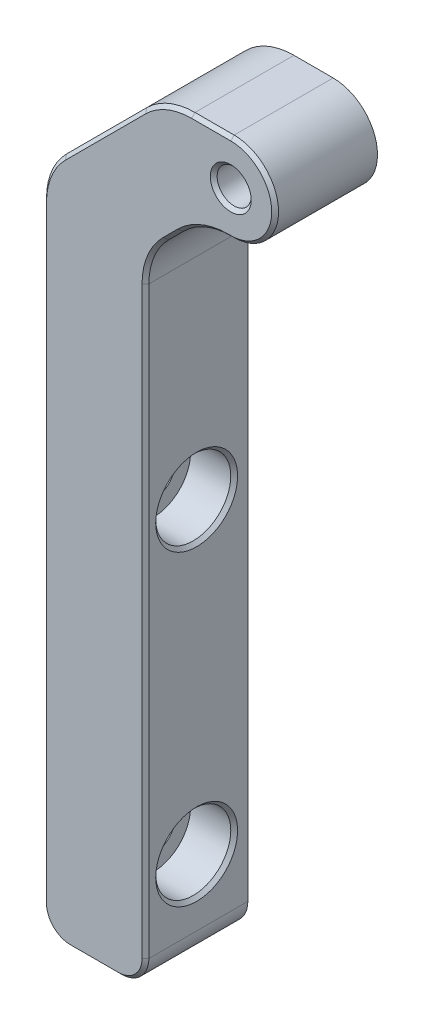
ISO-10303-21;
HEADER;
FILE_DESCRIPTION(('STEP AP214'),'2;1');
FILE_NAME('part.step','',(''),(''),'','','');
FILE_SCHEMA(('AUTOMOTIVE_DESIGN { 1 0 10303 214 1 1 1 1 }'));
ENDSEC;
DATA;
#1=APPLICATION_CONTEXT('core data for automotive mechanical design processes');
#2=APPLICATION_PROTOCOL_DEFINITION('international standard','automotive_design',2000,#1);
#3=PRODUCT_CONTEXT('',#1,'mechanical');
#4=PRODUCT('Part','Part','',(#3));
#5=PRODUCT_RELATED_PRODUCT_CATEGORY('part','',(#4));
#6=PRODUCT_DEFINITION_FORMATION('','',#4);
#7=PRODUCT_DEFINITION_CONTEXT('part definition',#1,'design');
#8=PRODUCT_DEFINITION('design','',#6,#7);
#9=PRODUCT_DEFINITION_SHAPE('','',#8);
#10=(LENGTH_UNIT() NAMED_UNIT(*) SI_UNIT(.MILLI.,.METRE.));
#11=(NAMED_UNIT(*) PLANE_ANGLE_UNIT() SI_UNIT($,.RADIAN.));
#12=(NAMED_UNIT(*) SI_UNIT($,.STERADIAN.) SOLID_ANGLE_UNIT());
#13=UNCERTAINTY_MEASURE_WITH_UNIT(LENGTH_MEASURE(1.E-05),#10,'distance_accuracy_value','');
#14=(GEOMETRIC_REPRESENTATION_CONTEXT(3) GLOBAL_UNCERTAINTY_ASSIGNED_CONTEXT((#13)) GLOBAL_UNIT_ASSIGNED_CONTEXT((#10,
#11,#12)) REPRESENTATION_CONTEXT('',''));
#15=CARTESIAN_POINT('',(0.,0.,0.));
#16=DIRECTION('',(0.,0.,1.));
#17=DIRECTION('',(1.,0.,0.));
#18=AXIS2_PLACEMENT_3D('',#15,#16,#17);
#19=CARTESIAN_POINT('',(26.4140960718114,32.7908047863379,15.));
#20=DIRECTION('',(0.,0.,-1.));
#21=DIRECTION('',(-1.,0.,0.));
#22=AXIS2_PLACEMENT_3D('',#19,#20,#21);
#23=CYLINDRICAL_SURFACE('',#22,6.49999999999695);
#24=DIRECTION('',(0.,0.,-1.));
#25=VECTOR('',#24,1.);
#26=CARTESIAN_POINT('',(26.4140960718114,39.2908047863348,15.));
#27=LINE('',#26,#25);
#28=CARTESIAN_POINT('',(26.4140960718114,39.2908047863348,14.5));
#29=VERTEX_POINT('',#28);
#30=CARTESIAN_POINT('',(26.4140960718114,39.2908047863348,0.));
#31=VERTEX_POINT('',#30);
#32=EDGE_CURVE('E178',#29,#31,#27,.T.);
#33=ORIENTED_EDGE('',*,*,#32,.F.);
#34=CARTESIAN_POINT('',(26.4140960718114,32.7908047863379,14.5));
#35=DIRECTION('',(0.,0.,1.));
#36=DIRECTION('',(1.,0.,0.));
#37=AXIS2_PLACEMENT_3D('',#34,#35,#36);
#38=CIRCLE('',#37,6.49999999999695);
#39=CARTESIAN_POINT('',(26.4140960718114,26.2908047863409,14.5));
#40=VERTEX_POINT('',#39);
#41=EDGE_CURVE('E324',#29,#40,#38,.F.);
#42=ORIENTED_EDGE('',*,*,#41,.T.);
#43=DIRECTION('',(0.,0.,-1.));
#44=VECTOR('',#43,1.);
#45=CARTESIAN_POINT('',(26.4140960718114,26.2908047863409,15.));
#46=LINE('',#45,#44);
#47=CARTESIAN_POINT('',(26.4140960718114,26.2908047863409,0.));
#48=VERTEX_POINT('',#47);
#49=EDGE_CURVE('E202',#40,#48,#46,.T.);
#50=ORIENTED_EDGE('',*,*,#49,.T.);
#51=CARTESIAN_POINT('',(26.4140960718114,32.7908047863379,0.));
#52=DIRECTION('',(0.,0.,1.));
#53=DIRECTION('',(1.,0.,0.));
#54=AXIS2_PLACEMENT_3D('',#51,#52,#53);
#55=CIRCLE('',#54,6.49999999999695);
#56=EDGE_CURVE('E196',#48,#31,#55,.T.);
#57=ORIENTED_EDGE('',*,*,#56,.T.);
#58=EDGE_LOOP('',(#33,#42,#50,#57));
#59=FACE_BOUND('',#58,.T.);
#60=ADVANCED_FACE('F33',(#59),#23,.T.);
#61=CARTESIAN_POINT('',(26.4140960718114,39.2908047863348,15.));
#62=DIRECTION('',(0.,-1.,0.));
#63=DIRECTION('',(0.,0.,-1.));
#64=AXIS2_PLACEMENT_3D('',#61,#62,#63);
#65=PLANE('',#64);
#66=DIRECTION('',(0.,0.,-1.));
#67=VECTOR('',#66,1.);
#68=CARTESIAN_POINT('',(20.6714553846794,39.2908047863348,15.));
#69=LINE('',#68,#67);
#70=CARTESIAN_POINT('',(20.6714553846794,39.2908047863348,14.5));
#71=VERTEX_POINT('',#70);
#72=CARTESIAN_POINT('',(20.6714553846794,39.2908047863348,0.));
#73=VERTEX_POINT('',#72);
#74=EDGE_CURVE('E190',#71,#73,#69,.T.);
#75=ORIENTED_EDGE('',*,*,#74,.F.);
#76=DIRECTION('',(1.,0.,0.));
#77=VECTOR('',#76,1.);
#78=CARTESIAN_POINT('',(26.4140960718114,39.2908047863348,14.5));
#79=LINE('',#78,#77);
#80=EDGE_CURVE('E185',#71,#29,#79,.T.);
#81=ORIENTED_EDGE('',*,*,#80,.T.);
#82=ORIENTED_EDGE('',*,*,#32,.T.);
#83=DIRECTION('',(-1.,0.,0.));
#84=VECTOR('',#83,1.);
#85=CARTESIAN_POINT('',(26.4140960718114,39.2908047863348,0.));
#86=LINE('',#85,#84);
#87=EDGE_CURVE('E182',#31,#73,#86,.T.);
#88=ORIENTED_EDGE('',*,*,#87,.T.);
#89=EDGE_LOOP('',(#75,#81,#82,#88));
#90=FACE_BOUND('',#89,.T.);
#91=ADVANCED_FACE('F181',(#90),#65,.F.);
#92=CARTESIAN_POINT('',(20.6714553846793,29.2908047863348,15.));
#93=DIRECTION('',(0.,0.,-1.));
#94=DIRECTION('',(-1.,0.,0.));
#95=AXIS2_PLACEMENT_3D('',#92,#93,#94);
#96=CYLINDRICAL_SURFACE('',#95,10.);
#97=DIRECTION('',(0.,0.,-1.));
#98=VECTOR('',#97,1.);
#99=CARTESIAN_POINT('',(13.6003875728138,36.3618725982003,15.));
#100=LINE('',#99,#98);
#101=CARTESIAN_POINT('',(13.6003875728138,36.3618725982003,14.5));
#102=VERTEX_POINT('',#101);
#103=CARTESIAN_POINT('',(13.6003875728138,36.3618725982003,0.));
#104=VERTEX_POINT('',#103);
#105=EDGE_CURVE('E265',#102,#104,#100,.T.);
#106=ORIENTED_EDGE('',*,*,#105,.F.);
#107=CARTESIAN_POINT('',(20.6714553846793,29.2908047863348,14.5));
#108=DIRECTION('',(0.,0.,1.));
#109=DIRECTION('',(1.,0.,0.));
#110=AXIS2_PLACEMENT_3D('',#107,#108,#109);
#111=CIRCLE('',#110,10.);
#112=EDGE_CURVE('E316',#102,#71,#111,.F.);
#113=ORIENTED_EDGE('',*,*,#112,.T.);
#114=ORIENTED_EDGE('',*,*,#74,.T.);
#115=CARTESIAN_POINT('',(20.6714553846793,29.2908047863348,0.));
#116=DIRECTION('',(0.,0.,1.));
#117=DIRECTION('',(1.,0.,0.));
#118=AXIS2_PLACEMENT_3D('',#115,#116,#117);
#119=CIRCLE('',#118,10.);
#120=EDGE_CURVE('E199',#73,#104,#119,.T.);
#121=ORIENTED_EDGE('',*,*,#120,.T.);
#122=EDGE_LOOP('',(#106,#113,#114,#121));
#123=FACE_BOUND('',#122,.T.);
#124=ADVANCED_FACE('F433',(#123),#96,.T.);
#125=CARTESIAN_POINT('',(13.6003875728138,36.3618725982003,15.));
#126=DIRECTION('',(0.707106781186547,-0.707106781186547,0.));
#127=DIRECTION('',(0.707106781186548,0.707106781186548,0.));
#128=AXIS2_PLACEMENT_3D('',#125,#126,#127);
#129=PLANE('',#128);
#130=DIRECTION('',(0.,0.,-1.));
#131=VECTOR('',#130,1.);
#132=CARTESIAN_POINT('',(1.84302825994298,24.6045132853294,15.));
#133=LINE('',#132,#131);
#134=CARTESIAN_POINT('',(1.84302825994298,24.6045132853294,14.5));
#135=VERTEX_POINT('',#134);
#136=CARTESIAN_POINT('',(1.84302825994298,24.6045132853294,0.));
#137=VERTEX_POINT('',#136);
#138=EDGE_CURVE('E263',#135,#137,#133,.T.);
#139=ORIENTED_EDGE('',*,*,#138,.F.);
#140=DIRECTION('',(0.707106781186548,0.707106781186548,0.));
#141=VECTOR('',#140,1.);
#142=CARTESIAN_POINT('',(13.6003875728138,36.3618725982003,14.5));
#143=LINE('',#142,#141);
#144=EDGE_CURVE('E319',#135,#102,#143,.T.);
#145=ORIENTED_EDGE('',*,*,#144,.T.);
#146=ORIENTED_EDGE('',*,*,#105,.T.);
#147=DIRECTION('',(-0.707106781186547,-0.707106781186547,0.));
#148=VECTOR('',#147,1.);
#149=CARTESIAN_POINT('',(13.6003875728138,36.3618725982003,0.));
#150=LINE('',#149,#148);
#151=EDGE_CURVE('E212',#104,#137,#150,.T.);
#152=ORIENTED_EDGE('',*,*,#151,.T.);
#153=EDGE_LOOP('',(#139,#145,#146,#152));
#154=FACE_BOUND('',#153,.T.);
#155=ADVANCED_FACE('F549',(#154),#129,.F.);
#156=CARTESIAN_POINT('',(8.91409607180843,17.5334454734639,15.));
#157=DIRECTION('',(0.,0.,-1.));
#158=DIRECTION('',(-1.,0.,0.));
#159=AXIS2_PLACEMENT_3D('',#156,#157,#158);
#160=CYLINDRICAL_SURFACE('',#159,10.);
#161=DIRECTION('',(0.,0.,-1.));
#162=VECTOR('',#161,1.);
#163=CARTESIAN_POINT('',(-1.08590392819157,17.5334454734639,15.));
#164=LINE('',#163,#162);
#165=CARTESIAN_POINT('',(-1.08590392819157,17.5334454734639,14.5));
#166=VERTEX_POINT('',#165);
#167=CARTESIAN_POINT('',(-1.08590392819157,17.5334454734639,0.));
#168=VERTEX_POINT('',#167);
#169=EDGE_CURVE('E261',#166,#168,#164,.T.);
#170=ORIENTED_EDGE('',*,*,#169,.F.);
#171=CARTESIAN_POINT('',(8.91409607180843,17.5334454734639,14.5));
#172=DIRECTION('',(0.,0.,1.));
#173=DIRECTION('',(1.,0.,0.));
#174=AXIS2_PLACEMENT_3D('',#171,#172,#173);
#175=CIRCLE('',#174,10.);
#176=EDGE_CURVE('E322',#166,#135,#175,.F.);
#177=ORIENTED_EDGE('',*,*,#176,.T.);
#178=ORIENTED_EDGE('',*,*,#138,.T.);
#179=CARTESIAN_POINT('',(8.91409607180843,17.5334454734639,0.));
#180=DIRECTION('',(0.,0.,1.));
#181=DIRECTION('',(1.,0.,0.));
#182=AXIS2_PLACEMENT_3D('',#179,#180,#181);
#183=CIRCLE('',#182,10.);
#184=EDGE_CURVE('E215',#137,#168,#183,.T.);
#185=ORIENTED_EDGE('',*,*,#184,.T.);
#186=EDGE_LOOP('',(#170,#177,#178,#185));
#187=FACE_BOUND('',#186,.T.);
#188=ADVANCED_FACE('F545',(#187),#160,.T.);
#189=CARTESIAN_POINT('',(-1.08590392819158,-71.4592049495357,15.));
#190=DIRECTION('',(1.,0.,0.));
#191=DIRECTION('',(0.,0.,-1.));
#192=AXIS2_PLACEMENT_3D('',#189,#190,#191);
#193=PLANE('',#192);
#194=CARTESIAN_POINT('',(-1.08590392819158,-16.7091952136652,7.49999999999999));
#195=DIRECTION('',(1.,0.,0.));
#196=DIRECTION('',(0.,0.,-1.));
#197=AXIS2_PLACEMENT_3D('',#194,#195,#196);
#198=CIRCLE('',#197,3.3);
#199=CARTESIAN_POINT('',(-1.08590392819158,-16.7091952136652,4.19999999999999));
#200=VERTEX_POINT('',#199);
#201=EDGE_CURVE('E388',#200,#200,#198,.T.);
#202=ORIENTED_EDGE('',*,*,#201,.T.);
#203=EDGE_LOOP('',(#202));
#204=FACE_BOUND('',#203,.T.);
#205=CARTESIAN_POINT('',(-1.08590392819158,-61.7091952136652,7.49999999999999));
#206=DIRECTION('',(1.,0.,0.));
#207=DIRECTION('',(0.,0.,-1.));
#208=AXIS2_PLACEMENT_3D('',#205,#206,#207);
#209=CIRCLE('',#208,3.3);
#210=CARTESIAN_POINT('',(-1.08590392819158,-61.7091952136652,4.19999999999999));
#211=VERTEX_POINT('',#210);
#212=EDGE_CURVE('E207',#211,#211,#209,.T.);
#213=ORIENTED_EDGE('',*,*,#212,.T.);
#214=EDGE_LOOP('',(#213));
#215=FACE_BOUND('',#214,.T.);
#216=DIRECTION('',(0.,0.,-1.));
#217=VECTOR('',#216,1.);
#218=CARTESIAN_POINT('',(-1.08590392819158,-71.4592049495357,15.));
#219=LINE('',#218,#217);
#220=CARTESIAN_POINT('',(-1.08590392819158,-71.4592049495357,14.5));
#221=VERTEX_POINT('',#220);
#222=CARTESIAN_POINT('',(-1.08590392819158,-71.4592049495357,0.));
#223=VERTEX_POINT('',#222);
#224=EDGE_CURVE('E259',#221,#223,#219,.T.);
#225=ORIENTED_EDGE('',*,*,#224,.F.);
#226=DIRECTION('',(0.,1.,0.));
#227=VECTOR('',#226,1.);
#228=CARTESIAN_POINT('',(-1.08590392819158,17.5334454734639,14.5));
#229=LINE('',#228,#227);
#230=EDGE_CURVE('E326',#221,#166,#229,.T.);
#231=ORIENTED_EDGE('',*,*,#230,.T.);
#232=ORIENTED_EDGE('',*,*,#169,.T.);
#233=DIRECTION('',(0.,-1.,0.));
#234=VECTOR('',#233,1.);
#235=CARTESIAN_POINT('',(-1.08590392819158,-71.4592049495357,0.));
#236=LINE('',#235,#234);
#237=EDGE_CURVE('E218',#168,#223,#236,.T.);
#238=ORIENTED_EDGE('',*,*,#237,.T.);
#239=EDGE_LOOP('',(#225,#231,#232,#238));
#240=FACE_BOUND('',#239,.T.);
#241=ADVANCED_FACE('F401',(#204,#215,#240),#193,.F.);
#242=CARTESIAN_POINT('',(2.91409607180843,-71.4592049495357,15.));
#243=DIRECTION('',(0.,0.,-1.));
#244=DIRECTION('',(-1.,0.,0.));
#245=AXIS2_PLACEMENT_3D('',#242,#243,#244);
#246=CYLINDRICAL_SURFACE('',#245,4.);
#247=DIRECTION('',(0.,0.,-1.));
#248=VECTOR('',#247,1.);
#249=CARTESIAN_POINT('',(2.91409607180843,-75.4592049495357,15.));
#250=LINE('',#249,#248);
#251=CARTESIAN_POINT('',(2.91409607180843,-75.4592049495357,14.5));
#252=VERTEX_POINT('',#251);
#253=CARTESIAN_POINT('',(2.91409607180843,-75.4592049495357,0.));
#254=VERTEX_POINT('',#253);
#255=EDGE_CURVE('E257',#252,#254,#250,.T.);
#256=ORIENTED_EDGE('',*,*,#255,.F.);
#257=CARTESIAN_POINT('',(2.91409607180843,-71.4592049495357,14.5));
#258=DIRECTION('',(0.,0.,1.));
#259=DIRECTION('',(1.,0.,0.));
#260=AXIS2_PLACEMENT_3D('',#257,#258,#259);
#261=CIRCLE('',#260,4.);
#262=EDGE_CURVE('E330',#252,#221,#261,.F.);
#263=ORIENTED_EDGE('',*,*,#262,.T.);
#264=ORIENTED_EDGE('',*,*,#224,.T.);
#265=CARTESIAN_POINT('',(2.91409607180843,-71.4592049495357,0.));
#266=DIRECTION('',(0.,0.,1.));
#267=DIRECTION('',(-1.,0.,0.));
#268=AXIS2_PLACEMENT_3D('',#265,#266,#267);
#269=CIRCLE('',#268,4.);
#270=EDGE_CURVE('E221',#223,#254,#269,.T.);
#271=ORIENTED_EDGE('',*,*,#270,.T.);
#272=EDGE_LOOP('',(#256,#263,#264,#271));
#273=FACE_BOUND('',#272,.T.);
#274=ADVANCED_FACE('F515',(#273),#246,.T.);
#275=CARTESIAN_POINT('',(2.91409607180843,-75.4592049495357,15.));
#276=DIRECTION('',(0.,1.,0.));
#277=DIRECTION('',(0.,0.,1.));
#278=AXIS2_PLACEMENT_3D('',#275,#276,#277);
#279=PLANE('',#278);
#280=DIRECTION('',(0.,0.,-1.));
#281=VECTOR('',#280,1.);
#282=CARTESIAN_POINT('',(9.91409607180471,-75.4592049495357,15.));
#283=LINE('',#282,#281);
#284=CARTESIAN_POINT('',(9.91409607180471,-75.4592049495357,14.5));
#285=VERTEX_POINT('',#284);
#286=CARTESIAN_POINT('',(9.91409607180471,-75.4592049495357,0.));
#287=VERTEX_POINT('',#286);
#288=EDGE_CURVE('E255',#285,#287,#283,.T.);
#289=ORIENTED_EDGE('',*,*,#288,.F.);
#290=DIRECTION('',(-1.,0.,0.));
#291=VECTOR('',#290,1.);
#292=CARTESIAN_POINT('',(2.91409607180843,-75.4592049495357,14.5));
#293=LINE('',#292,#291);
#294=EDGE_CURVE('E334',#285,#252,#293,.T.);
#295=ORIENTED_EDGE('',*,*,#294,.T.);
#296=ORIENTED_EDGE('',*,*,#255,.T.);
#297=DIRECTION('',(1.,0.,0.));
#298=VECTOR('',#297,1.);
#299=CARTESIAN_POINT('',(2.91409607180843,-75.4592049495357,0.));
#300=LINE('',#299,#298);
#301=EDGE_CURVE('E224',#254,#287,#300,.T.);
#302=ORIENTED_EDGE('',*,*,#301,.T.);
#303=EDGE_LOOP('',(#289,#295,#296,#302));
#304=FACE_BOUND('',#303,.T.);
#305=ADVANCED_FACE('F513',(#304),#279,.F.);
#306=CARTESIAN_POINT('',(9.91409607180471,-71.4592049495357,15.));
#307=DIRECTION('',(0.,0.,-1.));
#308=DIRECTION('',(-1.,0.,0.));
#309=AXIS2_PLACEMENT_3D('',#306,#307,#308);
#310=CYLINDRICAL_SURFACE('',#309,4.);
#311=DIRECTION('',(0.,0.,-1.));
#312=VECTOR('',#311,1.);
#313=CARTESIAN_POINT('',(13.9140960718047,-71.4592049495357,15.));
#314=LINE('',#313,#312);
#315=CARTESIAN_POINT('',(13.9140960718047,-71.4592049495357,14.5));
#316=VERTEX_POINT('',#315);
#317=CARTESIAN_POINT('',(13.9140960718047,-71.4592049495357,0.));
#318=VERTEX_POINT('',#317);
#319=EDGE_CURVE('E253',#316,#318,#314,.T.);
#320=ORIENTED_EDGE('',*,*,#319,.F.);
#321=CARTESIAN_POINT('',(9.91409607180471,-71.4592049495357,14.5));
#322=DIRECTION('',(0.,0.,1.));
#323=DIRECTION('',(1.,0.,0.));
#324=AXIS2_PLACEMENT_3D('',#321,#322,#323);
#325=CIRCLE('',#324,4.);
#326=EDGE_CURVE('E42',#316,#285,#325,.F.);
#327=ORIENTED_EDGE('',*,*,#326,.T.);
#328=ORIENTED_EDGE('',*,*,#288,.T.);
#329=CARTESIAN_POINT('',(9.91409607180471,-71.4592049495357,0.));
#330=DIRECTION('',(0.,0.,1.));
#331=DIRECTION('',(1.,0.,0.));
#332=AXIS2_PLACEMENT_3D('',#329,#330,#331);
#333=CIRCLE('',#332,4.);
#334=EDGE_CURVE('E227',#287,#318,#333,.T.);
#335=ORIENTED_EDGE('',*,*,#334,.T.);
#336=EDGE_LOOP('',(#320,#327,#328,#335));
#337=FACE_BOUND('',#336,.T.);
#338=ADVANCED_FACE('F523',(#337),#310,.T.);
#339=CARTESIAN_POINT('',(13.9140960718047,-71.4592049495357,15.));
#340=DIRECTION('',(-1.,0.,0.));
#341=DIRECTION('',(0.,0.,1.));
#342=AXIS2_PLACEMENT_3D('',#339,#340,#341);
#343=PLANE('',#342);
#344=CARTESIAN_POINT('',(13.9140960718047,-61.7091952136652,7.49999999999999));
#345=DIRECTION('',(-1.,0.,0.));
#346=DIRECTION('',(0.,0.,1.));
#347=AXIS2_PLACEMENT_3D('',#344,#345,#346);
#348=CIRCLE('',#347,5.99999999999998);
#349=CARTESIAN_POINT('',(13.9140960718047,-61.7091952136652,13.5));
#350=VERTEX_POINT('',#349);
#351=EDGE_CURVE('E275',#350,#350,#348,.T.);
#352=ORIENTED_EDGE('',*,*,#351,.T.);
#353=EDGE_LOOP('',(#352));
#354=FACE_BOUND('',#353,.T.);
#355=CARTESIAN_POINT('',(13.9140960718047,-16.7091952136652,7.49999999999999));
#356=DIRECTION('',(-1.,0.,0.));
#357=DIRECTION('',(0.,0.,1.));
#358=AXIS2_PLACEMENT_3D('',#355,#356,#357);
#359=CIRCLE('',#358,5.99999999999998);
#360=CARTESIAN_POINT('',(13.9140960718047,-16.7091952136652,13.5));
#361=VERTEX_POINT('',#360);
#362=EDGE_CURVE('E272',#361,#361,#359,.T.);
#363=ORIENTED_EDGE('',*,*,#362,.T.);
#364=EDGE_LOOP('',(#363));
#365=FACE_BOUND('',#364,.T.);
#366=DIRECTION('',(0.,0.,-1.));
#367=VECTOR('',#366,1.);
#368=CARTESIAN_POINT('',(13.9140960718047,14.1486691626099,15.));
#369=LINE('',#368,#367);
#370=CARTESIAN_POINT('',(13.9140960718047,14.1486691626099,14.5));
#371=VERTEX_POINT('',#370);
#372=CARTESIAN_POINT('',(13.9140960718047,14.1486691626099,0.));
#373=VERTEX_POINT('',#372);
#374=EDGE_CURVE('E251',#371,#373,#369,.T.);
#375=ORIENTED_EDGE('',*,*,#374,.F.);
#376=DIRECTION('',(0.,-1.,0.));
#377=VECTOR('',#376,1.);
#378=CARTESIAN_POINT('',(13.9140960718047,-71.4592049495357,14.5));
#379=LINE('',#378,#377);
#380=EDGE_CURVE('E270',#371,#316,#379,.T.);
#381=ORIENTED_EDGE('',*,*,#380,.T.);
#382=ORIENTED_EDGE('',*,*,#319,.T.);
#383=DIRECTION('',(0.,1.,0.));
#384=VECTOR('',#383,1.);
#385=CARTESIAN_POINT('',(13.9140960718047,-71.4592049495357,0.));
#386=LINE('',#385,#384);
#387=EDGE_CURVE('E230',#318,#373,#386,.T.);
#388=ORIENTED_EDGE('',*,*,#387,.T.);
#389=EDGE_LOOP('',(#375,#381,#382,#388));
#390=FACE_BOUND('',#389,.T.);
#391=ADVANCED_FACE('F526',(#354,#365,#390),#343,.F.);
#392=CARTESIAN_POINT('',(23.9140960718047,14.14866916261,15.));
#393=DIRECTION('',(0.,0.,-1.));
#394=DIRECTION('',(-1.,0.,0.));
#395=AXIS2_PLACEMENT_3D('',#392,#393,#394);
#396=CYLINDRICAL_SURFACE('',#395,10.);
#397=DIRECTION('',(0.,0.,-1.));
#398=VECTOR('',#397,1.);
#399=CARTESIAN_POINT('',(16.8430282599393,21.2197369744755,15.));
#400=LINE('',#399,#398);
#401=CARTESIAN_POINT('',(16.8430282599393,21.2197369744755,14.5));
#402=VERTEX_POINT('',#401);
#403=CARTESIAN_POINT('',(16.8430282599393,21.2197369744755,0.));
#404=VERTEX_POINT('',#403);
#405=EDGE_CURVE('E249',#402,#404,#400,.T.);
#406=ORIENTED_EDGE('',*,*,#405,.F.);
#407=CARTESIAN_POINT('',(23.9140960718047,14.14866916261,14.5));
#408=DIRECTION('',(0.,0.,1.));
#409=DIRECTION('',(1.,0.,0.));
#410=AXIS2_PLACEMENT_3D('',#407,#408,#409);
#411=CIRCLE('',#410,10.);
#412=EDGE_CURVE('E11',#402,#371,#411,.T.);
#413=ORIENTED_EDGE('',*,*,#412,.T.);
#414=ORIENTED_EDGE('',*,*,#374,.T.);
#415=CARTESIAN_POINT('',(23.9140960718047,14.14866916261,0.));
#416=DIRECTION('',(0.,0.,-1.));
#417=DIRECTION('',(1.,0.,0.));
#418=AXIS2_PLACEMENT_3D('',#415,#416,#417);
#419=CIRCLE('',#418,10.);
#420=EDGE_CURVE('E233',#373,#404,#419,.T.);
#421=ORIENTED_EDGE('',*,*,#420,.T.);
#422=EDGE_LOOP('',(#406,#413,#414,#421));
#423=FACE_BOUND('',#422,.T.);
#424=ADVANCED_FACE('F528',(#423),#396,.F.);
#425=CARTESIAN_POINT('',(16.8430282599393,21.2197369744755,15.));
#426=DIRECTION('',(-0.707106781186547,0.707106781186547,0.));
#427=DIRECTION('',(-0.707106781186548,-0.707106781186548,0.));
#428=AXIS2_PLACEMENT_3D('',#425,#426,#427);
#429=PLANE('',#428);
#430=DIRECTION('',(0.,0.,-1.));
#431=VECTOR('',#430,1.);
#432=CARTESIAN_POINT('',(18.9851638836702,23.3618725982064,15.));
#433=LINE('',#432,#431);
#434=CARTESIAN_POINT('',(18.9851638836702,23.3618725982064,14.5));
#435=VERTEX_POINT('',#434);
#436=CARTESIAN_POINT('',(18.9851638836702,23.3618725982064,0.));
#437=VERTEX_POINT('',#436);
#438=EDGE_CURVE('E247',#435,#437,#433,.T.);
#439=ORIENTED_EDGE('',*,*,#438,.F.);
#440=DIRECTION('',(-0.707106781186548,-0.707106781186548,0.));
#441=VECTOR('',#440,1.);
#442=CARTESIAN_POINT('',(16.8430282599393,21.2197369744755,14.5));
#443=LINE('',#442,#441);
#444=EDGE_CURVE('E50',#435,#402,#443,.T.);
#445=ORIENTED_EDGE('',*,*,#444,.T.);
#446=ORIENTED_EDGE('',*,*,#405,.T.);
#447=DIRECTION('',(0.707106781186548,0.707106781186548,0.));
#448=VECTOR('',#447,1.);
#449=CARTESIAN_POINT('',(16.8430282599393,21.2197369744755,0.));
#450=LINE('',#449,#448);
#451=EDGE_CURVE('E236',#404,#437,#450,.T.);
#452=ORIENTED_EDGE('',*,*,#451,.T.);
#453=EDGE_LOOP('',(#439,#445,#446,#452));
#454=FACE_BOUND('',#453,.T.);
#455=ADVANCED_FACE('F572',(#454),#429,.F.);
#456=CARTESIAN_POINT('',(26.0562316955357,16.2908047863409,15.));
#457=DIRECTION('',(0.,0.,-1.));
#458=DIRECTION('',(-1.,0.,0.));
#459=AXIS2_PLACEMENT_3D('',#456,#457,#458);
#460=CYLINDRICAL_SURFACE('',#459,10.);
#461=DIRECTION('',(0.,0.,-1.));
#462=VECTOR('',#461,1.);
#463=CARTESIAN_POINT('',(26.0562316955357,26.2908047863409,15.));
#464=LINE('',#463,#462);
#465=CARTESIAN_POINT('',(26.0562316955357,26.2908047863409,14.5));
#466=VERTEX_POINT('',#465);
#467=CARTESIAN_POINT('',(26.0562316955357,26.2908047863409,0.));
#468=VERTEX_POINT('',#467);
#469=EDGE_CURVE('E245',#466,#468,#464,.T.);
#470=ORIENTED_EDGE('',*,*,#469,.F.);
#471=CARTESIAN_POINT('',(26.0562316955357,16.2908047863409,14.5));
#472=DIRECTION('',(0.,0.,1.));
#473=DIRECTION('',(1.,0.,0.));
#474=AXIS2_PLACEMENT_3D('',#471,#472,#473);
#475=CIRCLE('',#474,10.);
#476=EDGE_CURVE('E332',#466,#435,#475,.T.);
#477=ORIENTED_EDGE('',*,*,#476,.T.);
#478=ORIENTED_EDGE('',*,*,#438,.T.);
#479=CARTESIAN_POINT('',(26.0562316955357,16.2908047863409,0.));
#480=DIRECTION('',(0.,0.,-1.));
#481=DIRECTION('',(-1.,0.,0.));
#482=AXIS2_PLACEMENT_3D('',#479,#480,#481);
#483=CIRCLE('',#482,10.);
#484=EDGE_CURVE('E239',#437,#468,#483,.T.);
#485=ORIENTED_EDGE('',*,*,#484,.T.);
#486=EDGE_LOOP('',(#470,#477,#478,#485));
#487=FACE_BOUND('',#486,.T.);
#488=ADVANCED_FACE('F571',(#487),#460,.F.);
#489=CARTESIAN_POINT('',(26.4140960718114,26.2908047863409,15.));
#490=DIRECTION('',(0.,1.,0.));
#491=DIRECTION('',(0.,0.,1.));
#492=AXIS2_PLACEMENT_3D('',#489,#490,#491);
#493=PLANE('',#492);
#494=ORIENTED_EDGE('',*,*,#49,.F.);
#495=DIRECTION('',(-1.,0.,0.));
#496=VECTOR('',#495,1.);
#497=CARTESIAN_POINT('',(26.0562316955357,26.2908047863409,14.5));
#498=LINE('',#497,#496);
#499=EDGE_CURVE('E328',#40,#466,#498,.T.);
#500=ORIENTED_EDGE('',*,*,#499,.T.);
#501=ORIENTED_EDGE('',*,*,#469,.T.);
#502=DIRECTION('',(1.,0.,0.));
#503=VECTOR('',#502,1.);
#504=CARTESIAN_POINT('',(26.4140960718114,26.2908047863409,0.));
#505=LINE('',#504,#503);
#506=EDGE_CURVE('E242',#468,#48,#505,.T.);
#507=ORIENTED_EDGE('',*,*,#506,.T.);
#508=EDGE_LOOP('',(#494,#500,#501,#507));
#509=FACE_BOUND('',#508,.T.);
#510=ADVANCED_FACE('F566',(#509),#493,.F.);
#511=CARTESIAN_POINT('',(26.4140960718114,32.7908047863379,15.));
#512=DIRECTION('',(0.,0.,1.));
#513=DIRECTION('',(1.,0.,0.));
#514=AXIS2_PLACEMENT_3D('',#511,#512,#513);
#515=PLANE('',#514);
#516=CARTESIAN_POINT('',(26.4140960718114,32.7908047863379,15.));
#517=DIRECTION('',(0.,0.,1.));
#518=DIRECTION('',(1.,0.,0.));
#519=AXIS2_PLACEMENT_3D('',#516,#517,#518);
#520=CIRCLE('',#519,2.99999999999999);
#521=CARTESIAN_POINT('',(29.4140960718114,32.7908047863379,15.));
#522=VERTEX_POINT('',#521);
#523=EDGE_CURVE('E313',#522,#522,#520,.F.);
#524=ORIENTED_EDGE('',*,*,#523,.T.);
#525=EDGE_LOOP('',(#524));
#526=FACE_BOUND('',#525,.T.);
#527=DIRECTION('',(-1.,0.,0.));
#528=VECTOR('',#527,1.);
#529=CARTESIAN_POINT('',(20.6714553846794,38.7908047863348,15.));
#530=LINE('',#529,#528);
#531=CARTESIAN_POINT('',(26.4140960718114,38.7908047863348,15.));
#532=VERTEX_POINT('',#531);
#533=CARTESIAN_POINT('',(20.6714553846794,38.7908047863348,15.));
#534=VERTEX_POINT('',#533);
#535=EDGE_CURVE('E306',#532,#534,#530,.T.);
#536=ORIENTED_EDGE('',*,*,#535,.T.);
#537=CARTESIAN_POINT('',(20.6714553846793,29.2908047863348,15.));
#538=DIRECTION('',(0.,0.,1.));
#539=DIRECTION('',(1.,0.,0.));
#540=AXIS2_PLACEMENT_3D('',#537,#538,#539);
#541=CIRCLE('',#540,9.50000000000001);
#542=CARTESIAN_POINT('',(13.9539409634071,36.008319207607,15.));
#543=VERTEX_POINT('',#542);
#544=EDGE_CURVE('E310',#534,#543,#541,.T.);
#545=ORIENTED_EDGE('',*,*,#544,.T.);
#546=DIRECTION('',(-0.707106781186548,-0.707106781186548,0.));
#547=VECTOR('',#546,1.);
#548=CARTESIAN_POINT('',(2.19658165053625,24.2509598947361,15.));
#549=LINE('',#548,#547);
#550=CARTESIAN_POINT('',(2.19658165053625,24.2509598947361,15.));
#551=VERTEX_POINT('',#550);
#552=EDGE_CURVE('E308',#543,#551,#549,.T.);
#553=ORIENTED_EDGE('',*,*,#552,.T.);
#554=CARTESIAN_POINT('',(8.91409607180843,17.5334454734639,15.));
#555=DIRECTION('',(0.,0.,1.));
#556=DIRECTION('',(1.,0.,0.));
#557=AXIS2_PLACEMENT_3D('',#554,#555,#556);
#558=CIRCLE('',#557,9.50000000000001);
#559=CARTESIAN_POINT('',(-0.585903928191578,17.5334454734639,15.));
#560=VERTEX_POINT('',#559);
#561=EDGE_CURVE('E304',#551,#560,#558,.T.);
#562=ORIENTED_EDGE('',*,*,#561,.T.);
#563=DIRECTION('',(0.,-1.,0.));
#564=VECTOR('',#563,1.);
#565=CARTESIAN_POINT('',(-0.585903928191578,-71.4592049495357,15.));
#566=LINE('',#565,#564);
#567=CARTESIAN_POINT('',(-0.585903928191578,-71.4592049495357,15.));
#568=VERTEX_POINT('',#567);
#569=EDGE_CURVE('E300',#560,#568,#566,.T.);
#570=ORIENTED_EDGE('',*,*,#569,.T.);
#571=CARTESIAN_POINT('',(2.91409607180843,-71.4592049495357,15.));
#572=DIRECTION('',(0.,0.,1.));
#573=DIRECTION('',(1.,0.,0.));
#574=AXIS2_PLACEMENT_3D('',#571,#572,#573);
#575=CIRCLE('',#574,3.5);
#576=CARTESIAN_POINT('',(2.91409607180843,-74.9592049495357,15.));
#577=VERTEX_POINT('',#576);
#578=EDGE_CURVE('E296',#568,#577,#575,.T.);
#579=ORIENTED_EDGE('',*,*,#578,.T.);
#580=DIRECTION('',(1.,0.,0.));
#581=VECTOR('',#580,1.);
#582=CARTESIAN_POINT('',(9.91409607180471,-74.9592049495357,15.));
#583=LINE('',#582,#581);
#584=CARTESIAN_POINT('',(9.91409607180471,-74.9592049495357,15.));
#585=VERTEX_POINT('',#584);
#586=EDGE_CURVE('E292',#577,#585,#583,.T.);
#587=ORIENTED_EDGE('',*,*,#586,.T.);
#588=CARTESIAN_POINT('',(9.91409607180471,-71.4592049495357,15.));
#589=DIRECTION('',(0.,0.,1.));
#590=DIRECTION('',(1.,0.,0.));
#591=AXIS2_PLACEMENT_3D('',#588,#589,#590);
#592=CIRCLE('',#591,3.5);
#593=CARTESIAN_POINT('',(13.4140960718047,-71.4592049495357,15.));
#594=VERTEX_POINT('',#593);
#595=EDGE_CURVE('E288',#585,#594,#592,.T.);
#596=ORIENTED_EDGE('',*,*,#595,.T.);
#597=DIRECTION('',(0.,1.,0.));
#598=VECTOR('',#597,1.);
#599=CARTESIAN_POINT('',(13.4140960718047,14.1486691626099,15.));
#600=LINE('',#599,#598);
#601=CARTESIAN_POINT('',(13.4140960718047,14.1486691626099,15.));
#602=VERTEX_POINT('',#601);
#603=EDGE_CURVE('E284',#594,#602,#600,.T.);
#604=ORIENTED_EDGE('',*,*,#603,.T.);
#605=CARTESIAN_POINT('',(23.9140960718047,14.14866916261,15.));
#606=DIRECTION('',(0.,0.,1.));
#607=DIRECTION('',(1.,0.,0.));
#608=AXIS2_PLACEMENT_3D('',#605,#606,#607);
#609=CIRCLE('',#608,10.5);
#610=CARTESIAN_POINT('',(16.489474869346,21.5732903650688,15.));
#611=VERTEX_POINT('',#610);
#612=EDGE_CURVE('E286',#602,#611,#609,.F.);
#613=ORIENTED_EDGE('',*,*,#612,.T.);
#614=DIRECTION('',(0.707106781186548,0.707106781186548,0.));
#615=VECTOR('',#614,1.);
#616=CARTESIAN_POINT('',(18.6316104930769,23.7154259887997,15.));
#617=LINE('',#616,#615);
#618=CARTESIAN_POINT('',(18.6316104930769,23.7154259887997,15.));
#619=VERTEX_POINT('',#618);
#620=EDGE_CURVE('E290',#611,#619,#617,.T.);
#621=ORIENTED_EDGE('',*,*,#620,.T.);
#622=CARTESIAN_POINT('',(26.0562316955357,16.2908047863409,15.));
#623=DIRECTION('',(0.,0.,1.));
#624=DIRECTION('',(1.,0.,0.));
#625=AXIS2_PLACEMENT_3D('',#622,#623,#624);
#626=CIRCLE('',#625,10.5);
#627=CARTESIAN_POINT('',(26.0562316955357,26.7908047863409,15.));
#628=VERTEX_POINT('',#627);
#629=EDGE_CURVE('E294',#619,#628,#626,.F.);
#630=ORIENTED_EDGE('',*,*,#629,.T.);
#631=DIRECTION('',(1.,0.,0.));
#632=VECTOR('',#631,1.);
#633=CARTESIAN_POINT('',(26.4140960718114,26.7908047863409,15.));
#634=LINE('',#633,#632);
#635=CARTESIAN_POINT('',(26.4140960718114,26.7908047863409,15.));
#636=VERTEX_POINT('',#635);
#637=EDGE_CURVE('E298',#628,#636,#634,.T.);
#638=ORIENTED_EDGE('',*,*,#637,.T.);
#639=CARTESIAN_POINT('',(26.4140960718114,32.7908047863379,15.));
#640=DIRECTION('',(0.,0.,1.));
#641=DIRECTION('',(1.,0.,0.));
#642=AXIS2_PLACEMENT_3D('',#639,#640,#641);
#643=CIRCLE('',#642,5.99999999999695);
#644=EDGE_CURVE('E302',#636,#532,#643,.T.);
#645=ORIENTED_EDGE('',*,*,#644,.T.);
#646=EDGE_LOOP('',(#536,#545,#553,#562,#570,#579,#587,#596,#604,#613,#621,#630,#638,#645));
#647=FACE_BOUND('',#646,.T.);
#648=ADVANCED_FACE('F535',(#526,#647),#515,.T.);
#649=CARTESIAN_POINT('',(26.4140960718114,32.7908047863379,0.));
#650=DIRECTION('',(0.,0.,1.));
#651=DIRECTION('',(1.,0.,0.));
#652=AXIS2_PLACEMENT_3D('',#649,#650,#651);
#653=PLANE('',#652);
#654=CARTESIAN_POINT('',(26.4140960718114,32.7908047863379,0.));
#655=DIRECTION('',(0.,0.,1.));
#656=DIRECTION('',(1.,0.,0.));
#657=AXIS2_PLACEMENT_3D('',#654,#655,#656);
#658=CIRCLE('',#657,2.5);
#659=CARTESIAN_POINT('',(28.9140960718114,32.7908047863379,0.));
#660=VERTEX_POINT('',#659);
#661=EDGE_CURVE('E204',#660,#660,#658,.T.);
#662=ORIENTED_EDGE('',*,*,#661,.T.);
#663=EDGE_LOOP('',(#662));
#664=FACE_BOUND('',#663,.T.);
#665=ORIENTED_EDGE('',*,*,#56,.F.);
#666=ORIENTED_EDGE('',*,*,#506,.F.);
#667=ORIENTED_EDGE('',*,*,#484,.F.);
#668=ORIENTED_EDGE('',*,*,#451,.F.);
#669=ORIENTED_EDGE('',*,*,#420,.F.);
#670=ORIENTED_EDGE('',*,*,#387,.F.);
#671=ORIENTED_EDGE('',*,*,#334,.F.);
#672=ORIENTED_EDGE('',*,*,#301,.F.);
#673=ORIENTED_EDGE('',*,*,#270,.F.);
#674=ORIENTED_EDGE('',*,*,#237,.F.);
#675=ORIENTED_EDGE('',*,*,#184,.F.);
#676=ORIENTED_EDGE('',*,*,#151,.F.);
#677=ORIENTED_EDGE('',*,*,#120,.F.);
#678=ORIENTED_EDGE('',*,*,#87,.F.);
#679=EDGE_LOOP('',(#665,#666,#667,#668,#669,#670,#671,#672,#673,#674,#675,#676,#677,#678));
#680=FACE_BOUND('',#679,.T.);
#681=ADVANCED_FACE('F194',(#664,#680),#653,.F.);
#682=CARTESIAN_POINT('',(26.4140960718114,32.7908047863379,15.));
#683=DIRECTION('',(0.,0.,1.));
#684=DIRECTION('',(1.,0.,0.));
#685=AXIS2_PLACEMENT_3D('',#682,#683,#684);
#686=CYLINDRICAL_SURFACE('',#685,2.49999999999999);
#687=CARTESIAN_POINT('',(26.4140960718114,32.7908047863379,14.5));
#688=DIRECTION('',(0.,0.,1.));
#689=DIRECTION('',(1.,0.,0.));
#690=AXIS2_PLACEMENT_3D('',#687,#688,#689);
#691=CIRCLE('',#690,2.49999999999999);
#692=CARTESIAN_POINT('',(28.9140960718114,32.7908047863379,14.5));
#693=VERTEX_POINT('',#692);
#694=EDGE_CURVE('E281',#693,#693,#691,.T.);
#695=ORIENTED_EDGE('',*,*,#694,.T.);
#696=EDGE_LOOP('',(#695));
#697=FACE_BOUND('',#696,.T.);
#698=ORIENTED_EDGE('',*,*,#661,.F.);
#699=EDGE_LOOP('',(#698));
#700=FACE_BOUND('',#699,.T.);
#701=ADVANCED_FACE('F408',(#697,#700),#686,.F.);
#702=CARTESIAN_POINT('',(13.9140960718047,-61.7091952136652,7.49999999999999));
#703=DIRECTION('',(1.,0.,0.));
#704=DIRECTION('',(0.,0.,-1.));
#705=AXIS2_PLACEMENT_3D('',#702,#703,#704);
#706=CYLINDRICAL_SURFACE('',#705,3.3);
#707=ORIENTED_EDGE('',*,*,#212,.F.);
#708=EDGE_LOOP('',(#707));
#709=FACE_BOUND('',#708,.T.);
#710=CARTESIAN_POINT('',(7.51409607180472,-61.7091952136652,7.49999999999999));
#711=DIRECTION('',(1.,0.,0.));
#712=DIRECTION('',(0.,0.,-1.));
#713=AXIS2_PLACEMENT_3D('',#710,#711,#712);
#714=CIRCLE('',#713,3.3);
#715=CARTESIAN_POINT('',(7.51409607180472,-61.7091952136652,4.19999999999999));
#716=VERTEX_POINT('',#715);
#717=EDGE_CURVE('E396',#716,#716,#714,.T.);
#718=ORIENTED_EDGE('',*,*,#717,.T.);
#719=EDGE_LOOP('',(#718));
#720=FACE_BOUND('',#719,.T.);
#721=ADVANCED_FACE('F404',(#709,#720),#706,.F.);
#722=CARTESIAN_POINT('',(7.51409607180472,-58.4091952136652,7.49999999999999));
#723=DIRECTION('',(-1.,0.,0.));
#724=DIRECTION('',(0.,0.,1.));
#725=AXIS2_PLACEMENT_3D('',#722,#723,#724);
#726=PLANE('',#725);
#727=ORIENTED_EDGE('',*,*,#717,.F.);
#728=EDGE_LOOP('',(#727));
#729=FACE_BOUND('',#728,.T.);
#730=CARTESIAN_POINT('',(7.51409607180472,-61.7091952136652,7.49999999999999));
#731=DIRECTION('',(1.,0.,0.));
#732=DIRECTION('',(0.,0.,-1.));
#733=AXIS2_PLACEMENT_3D('',#730,#731,#732);
#734=CIRCLE('',#733,5.5);
#735=CARTESIAN_POINT('',(7.51409607180472,-61.7091952136652,1.99999999999999));
#736=VERTEX_POINT('',#735);
#737=EDGE_CURVE('E393',#736,#736,#734,.T.);
#738=ORIENTED_EDGE('',*,*,#737,.T.);
#739=EDGE_LOOP('',(#738));
#740=FACE_BOUND('',#739,.T.);
#741=ADVANCED_FACE('F407',(#729,#740),#726,.F.);
#742=CARTESIAN_POINT('',(13.9140960718047,-61.7091952136652,7.49999999999999));
#743=DIRECTION('',(1.,0.,0.));
#744=DIRECTION('',(0.,0.,-1.));
#745=AXIS2_PLACEMENT_3D('',#742,#743,#744);
#746=CYLINDRICAL_SURFACE('',#745,5.5);
#747=CARTESIAN_POINT('',(13.4140960718047,-61.7091952136652,7.49999999999999));
#748=DIRECTION('',(-1.,0.,0.));
#749=DIRECTION('',(0.,0.,1.));
#750=AXIS2_PLACEMENT_3D('',#747,#748,#749);
#751=CIRCLE('',#750,5.5);
#752=CARTESIAN_POINT('',(13.4140960718047,-61.7091952136652,13.));
#753=VERTEX_POINT('',#752);
#754=EDGE_CURVE('E189',#753,#753,#751,.F.);
#755=ORIENTED_EDGE('',*,*,#754,.T.);
#756=EDGE_LOOP('',(#755));
#757=FACE_BOUND('',#756,.T.);
#758=ORIENTED_EDGE('',*,*,#737,.F.);
#759=EDGE_LOOP('',(#758));
#760=FACE_BOUND('',#759,.T.);
#761=ADVANCED_FACE('F414',(#757,#760),#746,.F.);
#762=CARTESIAN_POINT('',(13.9140960718047,-16.7091952136652,7.49999999999999));
#763=DIRECTION('',(1.,0.,0.));
#764=DIRECTION('',(0.,0.,-1.));
#765=AXIS2_PLACEMENT_3D('',#762,#763,#764);
#766=CYLINDRICAL_SURFACE('',#765,3.3);
#767=ORIENTED_EDGE('',*,*,#201,.F.);
#768=EDGE_LOOP('',(#767));
#769=FACE_BOUND('',#768,.T.);
#770=CARTESIAN_POINT('',(7.51409607180472,-16.7091952136652,7.49999999999999));
#771=DIRECTION('',(1.,0.,0.));
#772=DIRECTION('',(0.,0.,-1.));
#773=AXIS2_PLACEMENT_3D('',#770,#771,#772);
#774=CIRCLE('',#773,3.3);
#775=CARTESIAN_POINT('',(7.51409607180472,-16.7091952136652,4.19999999999999));
#776=VERTEX_POINT('',#775);
#777=EDGE_CURVE('E383',#776,#776,#774,.T.);
#778=ORIENTED_EDGE('',*,*,#777,.T.);
#779=EDGE_LOOP('',(#778));
#780=FACE_BOUND('',#779,.T.);
#781=ADVANCED_FACE('F419',(#769,#780),#766,.F.);
#782=CARTESIAN_POINT('',(7.51409607180472,-13.4091952136652,7.49999999999999));
#783=DIRECTION('',(-1.,0.,0.));
#784=DIRECTION('',(0.,0.,1.));
#785=AXIS2_PLACEMENT_3D('',#782,#783,#784);
#786=PLANE('',#785);
#787=ORIENTED_EDGE('',*,*,#777,.F.);
#788=EDGE_LOOP('',(#787));
#789=FACE_BOUND('',#788,.T.);
#790=CARTESIAN_POINT('',(7.51409607180472,-16.7091952136652,7.49999999999999));
#791=DIRECTION('',(1.,0.,0.));
#792=DIRECTION('',(0.,0.,-1.));
#793=AXIS2_PLACEMENT_3D('',#790,#791,#792);
#794=CIRCLE('',#793,5.5);
#795=CARTESIAN_POINT('',(7.51409607180472,-16.7091952136652,1.99999999999999));
#796=VERTEX_POINT('',#795);
#797=EDGE_CURVE('E377',#796,#796,#794,.T.);
#798=ORIENTED_EDGE('',*,*,#797,.T.);
#799=EDGE_LOOP('',(#798));
#800=FACE_BOUND('',#799,.T.);
#801=ADVANCED_FACE('F425',(#789,#800),#786,.F.);
#802=CARTESIAN_POINT('',(13.9140960718047,-16.7091952136652,7.49999999999999));
#803=DIRECTION('',(1.,0.,0.));
#804=DIRECTION('',(0.,0.,-1.));
#805=AXIS2_PLACEMENT_3D('',#802,#803,#804);
#806=CYLINDRICAL_SURFACE('',#805,5.5);
#807=CARTESIAN_POINT('',(13.4140960718047,-16.7091952136652,7.49999999999999));
#808=DIRECTION('',(-1.,0.,0.));
#809=DIRECTION('',(0.,0.,1.));
#810=AXIS2_PLACEMENT_3D('',#807,#808,#809);
#811=CIRCLE('',#810,5.5);
#812=CARTESIAN_POINT('',(13.4140960718047,-16.7091952136652,13.));
#813=VERTEX_POINT('',#812);
#814=EDGE_CURVE('E278',#813,#813,#811,.F.);
#815=ORIENTED_EDGE('',*,*,#814,.T.);
#816=EDGE_LOOP('',(#815));
#817=FACE_BOUND('',#816,.T.);
#818=ORIENTED_EDGE('',*,*,#797,.F.);
#819=EDGE_LOOP('',(#818));
#820=FACE_BOUND('',#819,.T.);
#821=ADVANCED_FACE('F441',(#817,#820),#806,.F.);
#822=CARTESIAN_POINT('',(13.4140960718047,-61.7091952136652,7.49999999999999));
#823=DIRECTION('',(1.,0.,0.));
#824=DIRECTION('',(0.,0.,-1.));
#825=AXIS2_PLACEMENT_3D('',#822,#823,#824);
#826=CONICAL_SURFACE('',#825,5.5,0.785398163397443);
#827=ORIENTED_EDGE('',*,*,#351,.F.);
#828=EDGE_LOOP('',(#827));
#829=FACE_BOUND('',#828,.T.);
#830=ORIENTED_EDGE('',*,*,#754,.F.);
#831=EDGE_LOOP('',(#830));
#832=FACE_BOUND('',#831,.T.);
#833=ADVANCED_FACE('F437',(#829,#832),#826,.F.);
#834=CARTESIAN_POINT('',(13.4140960718047,-16.7091952136652,7.49999999999999));
#835=DIRECTION('',(1.,0.,0.));
#836=DIRECTION('',(0.,0.,-1.));
#837=AXIS2_PLACEMENT_3D('',#834,#835,#836);
#838=CONICAL_SURFACE('',#837,5.5,0.785398163397443);
#839=ORIENTED_EDGE('',*,*,#362,.F.);
#840=EDGE_LOOP('',(#839));
#841=FACE_BOUND('',#840,.T.);
#842=ORIENTED_EDGE('',*,*,#814,.F.);
#843=EDGE_LOOP('',(#842));
#844=FACE_BOUND('',#843,.T.);
#845=ADVANCED_FACE('F440',(#841,#844),#838,.F.);
#846=CARTESIAN_POINT('',(26.4140960718114,32.7908047863379,14.5));
#847=DIRECTION('',(0.,0.,1.));
#848=DIRECTION('',(1.,0.,0.));
#849=AXIS2_PLACEMENT_3D('',#846,#847,#848);
#850=CONICAL_SURFACE('',#849,2.49999999999999,0.785398163397453);
#851=ORIENTED_EDGE('',*,*,#523,.F.);
#852=EDGE_LOOP('',(#851));
#853=FACE_BOUND('',#852,.T.);
#854=ORIENTED_EDGE('',*,*,#694,.F.);
#855=EDGE_LOOP('',(#854));
#856=FACE_BOUND('',#855,.T.);
#857=ADVANCED_FACE('F445',(#853,#856),#850,.F.);
#858=CARTESIAN_POINT('',(13.4140960718047,32.7908047863379,15.));
#859=DIRECTION('',(0.707106781186547,0.,0.707106781186547));
#860=DIRECTION('',(0.,-1.,0.));
#861=AXIS2_PLACEMENT_3D('',#858,#859,#860);
#862=PLANE('',#861);
#863=DIRECTION('',(-0.707106781186547,0.,0.707106781186547));
#864=VECTOR('',#863,1.);
#865=CARTESIAN_POINT('',(13.9140960718047,-71.4592049495357,14.5));
#866=LINE('',#865,#864);
#867=EDGE_CURVE('E371',#316,#594,#866,.T.);
#868=ORIENTED_EDGE('',*,*,#867,.F.);
#869=ORIENTED_EDGE('',*,*,#380,.F.);
#870=DIRECTION('',(0.707106781186547,0.,-0.707106781186547));
#871=VECTOR('',#870,1.);
#872=CARTESIAN_POINT('',(13.4140960718047,14.1486691626099,15.));
#873=LINE('',#872,#871);
#874=EDGE_CURVE('E37',#602,#371,#873,.T.);
#875=ORIENTED_EDGE('',*,*,#874,.F.);
#876=ORIENTED_EDGE('',*,*,#603,.F.);
#877=EDGE_LOOP('',(#868,#869,#875,#876));
#878=FACE_BOUND('',#877,.T.);
#879=ADVANCED_FACE('F35',(#878),#862,.T.);
#880=CARTESIAN_POINT('',(23.9140960718047,14.14866916261,15.));
#881=DIRECTION('',(0.,0.,1.));
#882=DIRECTION('',(1.,0.,0.));
#883=AXIS2_PLACEMENT_3D('',#880,#881,#882);
#884=CONICAL_SURFACE('',#883,10.5,0.785398163397448);
#885=ORIENTED_EDGE('',*,*,#874,.T.);
#886=ORIENTED_EDGE('',*,*,#412,.F.);
#887=DIRECTION('',(0.500000000000001,-0.500000000000001,-0.707106781186546));
#888=VECTOR('',#887,1.);
#889=CARTESIAN_POINT('',(16.489474869346,21.5732903650688,15.));
#890=LINE('',#889,#888);
#891=EDGE_CURVE('E369',#611,#402,#890,.T.);
#892=ORIENTED_EDGE('',*,*,#891,.F.);
#893=ORIENTED_EDGE('',*,*,#612,.F.);
#894=EDGE_LOOP('',(#885,#886,#892,#893));
#895=FACE_BOUND('',#894,.T.);
#896=ADVANCED_FACE('F496',(#895),#884,.F.);
#897=CARTESIAN_POINT('',(9.91409607180471,-71.4592049495357,15.));
#898=DIRECTION('',(0.,0.,-1.));
#899=DIRECTION('',(-1.,0.,0.));
#900=AXIS2_PLACEMENT_3D('',#897,#898,#899);
#901=CONICAL_SURFACE('',#900,3.5,0.785398163397448);
#902=ORIENTED_EDGE('',*,*,#867,.T.);
#903=ORIENTED_EDGE('',*,*,#595,.F.);
#904=DIRECTION('',(0.,0.707106781186547,0.707106781186547));
#905=VECTOR('',#904,1.);
#906=CARTESIAN_POINT('',(9.91409607180471,-75.4592049495357,14.5));
#907=LINE('',#906,#905);
#908=EDGE_CURVE('E366',#285,#585,#907,.T.);
#909=ORIENTED_EDGE('',*,*,#908,.F.);
#910=ORIENTED_EDGE('',*,*,#326,.F.);
#911=EDGE_LOOP('',(#902,#903,#909,#910));
#912=FACE_BOUND('',#911,.T.);
#913=ADVANCED_FACE('F493',(#912),#901,.T.);
#914=CARTESIAN_POINT('',(27.0605426812133,32.144358176936,15.));
#915=DIRECTION('',(0.500000000000001,-0.500000000000001,0.707106781186546));
#916=DIRECTION('',(-0.707106781186548,-0.707106781186548,0.));
#917=AXIS2_PLACEMENT_3D('',#914,#915,#916);
#918=PLANE('',#917);
#919=ORIENTED_EDGE('',*,*,#891,.T.);
#920=ORIENTED_EDGE('',*,*,#444,.F.);
#921=DIRECTION('',(0.500000000000003,-0.499999999999998,-0.707106781186547));
#922=VECTOR('',#921,1.);
#923=CARTESIAN_POINT('',(18.6316104930769,23.7154259887997,15.));
#924=LINE('',#923,#922);
#925=EDGE_CURVE('E363',#619,#435,#924,.T.);
#926=ORIENTED_EDGE('',*,*,#925,.F.);
#927=ORIENTED_EDGE('',*,*,#620,.F.);
#928=EDGE_LOOP('',(#919,#920,#926,#927));
#929=FACE_BOUND('',#928,.T.);
#930=ADVANCED_FACE('F489',(#929),#918,.T.);
#931=CARTESIAN_POINT('',(26.4140960718114,-74.9592049495357,15.));
#932=DIRECTION('',(0.,-0.707106781186547,0.707106781186547));
#933=DIRECTION('',(-1.,0.,0.));
#934=AXIS2_PLACEMENT_3D('',#931,#932,#933);
#935=PLANE('',#934);
#936=ORIENTED_EDGE('',*,*,#908,.T.);
#937=ORIENTED_EDGE('',*,*,#586,.F.);
#938=DIRECTION('',(0.,0.707106781186547,0.707106781186547));
#939=VECTOR('',#938,1.);
#940=CARTESIAN_POINT('',(2.91409607180843,-75.4592049495357,14.5));
#941=LINE('',#940,#939);
#942=EDGE_CURVE('E360',#252,#577,#941,.T.);
#943=ORIENTED_EDGE('',*,*,#942,.F.);
#944=ORIENTED_EDGE('',*,*,#294,.F.);
#945=EDGE_LOOP('',(#936,#937,#943,#944));
#946=FACE_BOUND('',#945,.T.);
#947=ADVANCED_FACE('F485',(#946),#935,.T.);
#948=CARTESIAN_POINT('',(26.0562316955357,16.2908047863409,15.));
#949=DIRECTION('',(0.,0.,1.));
#950=DIRECTION('',(1.,0.,0.));
#951=AXIS2_PLACEMENT_3D('',#948,#949,#950);
#952=CONICAL_SURFACE('',#951,10.5,0.785398163397448);
#953=ORIENTED_EDGE('',*,*,#925,.T.);
#954=ORIENTED_EDGE('',*,*,#476,.F.);
#955=DIRECTION('',(0.,-0.707106781186547,-0.707106781186547));
#956=VECTOR('',#955,1.);
#957=CARTESIAN_POINT('',(26.0562316955357,26.7908047863409,15.));
#958=LINE('',#957,#956);
#959=EDGE_CURVE('E357',#628,#466,#958,.T.);
#960=ORIENTED_EDGE('',*,*,#959,.F.);
#961=ORIENTED_EDGE('',*,*,#629,.F.);
#962=EDGE_LOOP('',(#953,#954,#960,#961));
#963=FACE_BOUND('',#962,.T.);
#964=ADVANCED_FACE('F481',(#963),#952,.F.);
#965=CARTESIAN_POINT('',(2.91409607180843,-71.4592049495357,15.));
#966=DIRECTION('',(0.,0.,-1.));
#967=DIRECTION('',(-1.,0.,0.));
#968=AXIS2_PLACEMENT_3D('',#965,#966,#967);
#969=CONICAL_SURFACE('',#968,3.5,0.785398163397448);
#970=ORIENTED_EDGE('',*,*,#942,.T.);
#971=ORIENTED_EDGE('',*,*,#578,.F.);
#972=DIRECTION('',(0.707106781186547,0.,0.707106781186547));
#973=VECTOR('',#972,1.);
#974=CARTESIAN_POINT('',(-1.08590392819158,-71.4592049495357,14.5));
#975=LINE('',#974,#973);
#976=EDGE_CURVE('E354',#221,#568,#975,.T.);
#977=ORIENTED_EDGE('',*,*,#976,.F.);
#978=ORIENTED_EDGE('',*,*,#262,.F.);
#979=EDGE_LOOP('',(#970,#971,#977,#978));
#980=FACE_BOUND('',#979,.T.);
#981=ADVANCED_FACE('F477',(#980),#969,.T.);
#982=CARTESIAN_POINT('',(26.4140960718114,26.7908047863409,15.));
#983=DIRECTION('',(0.,-0.707106781186547,0.707106781186547));
#984=DIRECTION('',(-1.,0.,0.));
#985=AXIS2_PLACEMENT_3D('',#982,#983,#984);
#986=PLANE('',#985);
#987=ORIENTED_EDGE('',*,*,#959,.T.);
#988=ORIENTED_EDGE('',*,*,#499,.F.);
#989=DIRECTION('',(0.,-0.707106781186547,-0.707106781186547));
#990=VECTOR('',#989,1.);
#991=CARTESIAN_POINT('',(26.4140960718114,26.7908047863409,15.));
#992=LINE('',#991,#990);
#993=EDGE_CURVE('E351',#636,#40,#992,.T.);
#994=ORIENTED_EDGE('',*,*,#993,.F.);
#995=ORIENTED_EDGE('',*,*,#637,.F.);
#996=EDGE_LOOP('',(#987,#988,#994,#995));
#997=FACE_BOUND('',#996,.T.);
#998=ADVANCED_FACE('F473',(#997),#986,.T.);
#999=CARTESIAN_POINT('',(-0.585903928191578,32.7908047863379,15.));
#1000=DIRECTION('',(-0.707106781186547,0.,0.707106781186547));
#1001=DIRECTION('',(0.,1.,0.));
#1002=AXIS2_PLACEMENT_3D('',#999,#1000,#1001);
#1003=PLANE('',#1002);
#1004=ORIENTED_EDGE('',*,*,#976,.T.);
#1005=ORIENTED_EDGE('',*,*,#569,.F.);
#1006=DIRECTION('',(0.707106781186547,0.,0.707106781186547));
#1007=VECTOR('',#1006,1.);
#1008=CARTESIAN_POINT('',(-1.08590392819158,17.5334454734639,14.5));
#1009=LINE('',#1008,#1007);
#1010=EDGE_CURVE('E348',#166,#560,#1009,.T.);
#1011=ORIENTED_EDGE('',*,*,#1010,.F.);
#1012=ORIENTED_EDGE('',*,*,#230,.F.);
#1013=EDGE_LOOP('',(#1004,#1005,#1011,#1012));
#1014=FACE_BOUND('',#1013,.T.);
#1015=ADVANCED_FACE('F469',(#1014),#1003,.T.);
#1016=CARTESIAN_POINT('',(26.4140960718114,32.7908047863379,15.));
#1017=DIRECTION('',(0.,0.,-1.));
#1018=DIRECTION('',(-1.,0.,0.));
#1019=AXIS2_PLACEMENT_3D('',#1016,#1017,#1018);
#1020=CONICAL_SURFACE('',#1019,5.99999999999695,0.785398163397448);
#1021=ORIENTED_EDGE('',*,*,#993,.T.);
#1022=ORIENTED_EDGE('',*,*,#41,.F.);
#1023=DIRECTION('',(0.,0.707106781186547,-0.707106781186547));
#1024=VECTOR('',#1023,1.);
#1025=CARTESIAN_POINT('',(26.4140960718114,38.7908047863348,15.));
#1026=LINE('',#1025,#1024);
#1027=EDGE_CURVE('E345',#532,#29,#1026,.T.);
#1028=ORIENTED_EDGE('',*,*,#1027,.F.);
#1029=ORIENTED_EDGE('',*,*,#644,.F.);
#1030=EDGE_LOOP('',(#1021,#1022,#1028,#1029));
#1031=FACE_BOUND('',#1030,.T.);
#1032=ADVANCED_FACE('F465',(#1031),#1020,.T.);
#1033=CARTESIAN_POINT('',(8.91409607180843,17.5334454734639,15.));
#1034=DIRECTION('',(0.,0.,-1.));
#1035=DIRECTION('',(-1.,0.,0.));
#1036=AXIS2_PLACEMENT_3D('',#1033,#1034,#1035);
#1037=CONICAL_SURFACE('',#1036,9.50000000000001,0.785398163397448);
#1038=ORIENTED_EDGE('',*,*,#1010,.T.);
#1039=ORIENTED_EDGE('',*,*,#561,.F.);
#1040=DIRECTION('',(0.500000000000002,-0.499999999999998,0.707106781186548));
#1041=VECTOR('',#1040,1.);
#1042=CARTESIAN_POINT('',(1.84302825994298,24.6045132853294,14.5));
#1043=LINE('',#1042,#1041);
#1044=EDGE_CURVE('E342',#135,#551,#1043,.T.);
#1045=ORIENTED_EDGE('',*,*,#1044,.F.);
#1046=ORIENTED_EDGE('',*,*,#176,.F.);
#1047=EDGE_LOOP('',(#1038,#1039,#1045,#1046));
#1048=FACE_BOUND('',#1047,.T.);
#1049=ADVANCED_FACE('F461',(#1048),#1037,.T.);
#1050=CARTESIAN_POINT('',(26.4140960718114,38.7908047863348,15.));
#1051=DIRECTION('',(0.,0.707106781186547,0.707106781186547));
#1052=DIRECTION('',(1.,0.,0.));
#1053=AXIS2_PLACEMENT_3D('',#1050,#1051,#1052);
#1054=PLANE('',#1053);
#1055=ORIENTED_EDGE('',*,*,#1027,.T.);
#1056=ORIENTED_EDGE('',*,*,#80,.F.);
#1057=DIRECTION('',(0.,0.707106781186547,-0.707106781186547));
#1058=VECTOR('',#1057,1.);
#1059=CARTESIAN_POINT('',(20.6714553846794,38.7908047863348,15.));
#1060=LINE('',#1059,#1058);
#1061=EDGE_CURVE('E340',#534,#71,#1060,.T.);
#1062=ORIENTED_EDGE('',*,*,#1061,.F.);
#1063=ORIENTED_EDGE('',*,*,#535,.F.);
#1064=EDGE_LOOP('',(#1055,#1056,#1062,#1063));
#1065=FACE_BOUND('',#1064,.T.);
#1066=ADVANCED_FACE('F457',(#1065),#1054,.T.);
#1067=CARTESIAN_POINT('',(18.5752613069747,40.6296395511746,15.));
#1068=DIRECTION('',(-0.500000000000001,0.500000000000001,0.707106781186546));
#1069=DIRECTION('',(0.707106781186548,0.707106781186548,0.));
#1070=AXIS2_PLACEMENT_3D('',#1067,#1068,#1069);
#1071=PLANE('',#1070);
#1072=ORIENTED_EDGE('',*,*,#1044,.T.);
#1073=ORIENTED_EDGE('',*,*,#552,.F.);
#1074=DIRECTION('',(0.500000000000003,-0.499999999999998,0.707106781186547));
#1075=VECTOR('',#1074,1.);
#1076=CARTESIAN_POINT('',(13.6003875728138,36.3618725982003,14.5));
#1077=LINE('',#1076,#1075);
#1078=EDGE_CURVE('E338',#102,#543,#1077,.T.);
#1079=ORIENTED_EDGE('',*,*,#1078,.F.);
#1080=ORIENTED_EDGE('',*,*,#144,.F.);
#1081=EDGE_LOOP('',(#1072,#1073,#1079,#1080));
#1082=FACE_BOUND('',#1081,.T.);
#1083=ADVANCED_FACE('F453',(#1082),#1071,.T.);
#1084=CARTESIAN_POINT('',(20.6714553846793,29.2908047863348,15.));
#1085=DIRECTION('',(0.,0.,-1.));
#1086=DIRECTION('',(-1.,0.,0.));
#1087=AXIS2_PLACEMENT_3D('',#1084,#1085,#1086);
#1088=CONICAL_SURFACE('',#1087,9.50000000000001,0.785398163397448);
#1089=ORIENTED_EDGE('',*,*,#1061,.T.);
#1090=ORIENTED_EDGE('',*,*,#112,.F.);
#1091=ORIENTED_EDGE('',*,*,#1078,.T.);
#1092=ORIENTED_EDGE('',*,*,#544,.F.);
#1093=EDGE_LOOP('',(#1089,#1090,#1091,#1092));
#1094=FACE_BOUND('',#1093,.T.);
#1095=ADVANCED_FACE('F450',(#1094),#1088,.T.);
#1096=CLOSED_SHELL('',(#60,#91,#124,#155,#188,#241,#274,#305,#338,#391,#424,#455,#488,#510,#648,
#681,#701,#721,#741,#761,#781,#801,#821,#833,#845,#857,#879,#896,#913,#930,#947,#964,#981,#998,
#1015,#1032,#1049,#1066,#1083,#1095));
#1097=MANIFOLD_SOLID_BREP('B2',#1096);
#1098=ADVANCED_BREP_SHAPE_REPRESENTATION('',(#18,#1097),#14);
#1099=SHAPE_DEFINITION_REPRESENTATION(#9,#1098);
ENDSEC;
END-ISO-10303-21;
